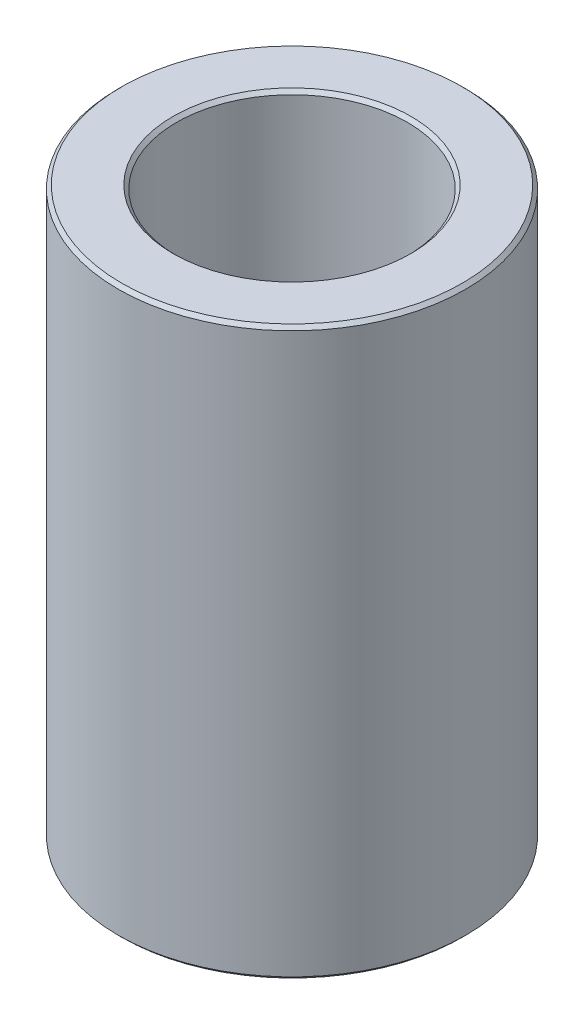
ISO-10303-21;
HEADER;
FILE_DESCRIPTION(('STEP AP214'),'2;1');
FILE_NAME('part.step','',(''),(''),'','','');
FILE_SCHEMA(('AUTOMOTIVE_DESIGN { 1 0 10303 214 1 1 1 1 }'));
ENDSEC;
DATA;
#1=APPLICATION_CONTEXT('core data for automotive mechanical design processes');
#2=APPLICATION_PROTOCOL_DEFINITION('international standard','automotive_design',2000,#1);
#3=PRODUCT_CONTEXT('',#1,'mechanical');
#4=PRODUCT('Part','Part','',(#3));
#5=PRODUCT_RELATED_PRODUCT_CATEGORY('part','',(#4));
#6=PRODUCT_DEFINITION_FORMATION('','',#4);
#7=PRODUCT_DEFINITION_CONTEXT('part definition',#1,'design');
#8=PRODUCT_DEFINITION('design','',#6,#7);
#9=PRODUCT_DEFINITION_SHAPE('','',#8);
#10=(LENGTH_UNIT() NAMED_UNIT(*) SI_UNIT(.MILLI.,.METRE.));
#11=(NAMED_UNIT(*) PLANE_ANGLE_UNIT() SI_UNIT($,.RADIAN.));
#12=(NAMED_UNIT(*) SI_UNIT($,.STERADIAN.) SOLID_ANGLE_UNIT());
#13=UNCERTAINTY_MEASURE_WITH_UNIT(LENGTH_MEASURE(1.E-05),#10,'distance_accuracy_value','');
#14=(GEOMETRIC_REPRESENTATION_CONTEXT(3) GLOBAL_UNCERTAINTY_ASSIGNED_CONTEXT((#13)) GLOBAL_UNIT_ASSIGNED_CONTEXT((#10,
#11,#12)) REPRESENTATION_CONTEXT('',''));
#15=CARTESIAN_POINT('',(0.,0.,0.));
#16=DIRECTION('',(0.,0.,1.));
#17=DIRECTION('',(1.,0.,0.));
#18=AXIS2_PLACEMENT_3D('',#15,#16,#17);
#19=CARTESIAN_POINT('',(0.,171.215724513851,0.));
#20=DIRECTION('',(0.,-1.,0.));
#21=DIRECTION('',(0.,0.,-1.));
#22=AXIS2_PLACEMENT_3D('',#19,#20,#21);
#23=CYLINDRICAL_SURFACE('',#22,52.5);
#24=CARTESIAN_POINT('',(0.,1.0499867533334,0.));
#25=DIRECTION('',(0.,1.,0.));
#26=DIRECTION('',(0.,0.,1.));
#27=AXIS2_PLACEMENT_3D('',#24,#25,#26);
#28=CIRCLE('',#27,52.5);
#29=CARTESIAN_POINT('',(0.,1.0499867533334,52.5));
#30=VERTEX_POINT('',#29);
#31=EDGE_CURVE('E10',#30,#30,#28,.T.);
#32=ORIENTED_EDGE('',*,*,#31,.T.);
#33=EDGE_LOOP('',(#32));
#34=FACE_BOUND('',#33,.T.);
#35=CARTESIAN_POINT('',(0.,170.165737760517,0.));
#36=DIRECTION('',(0.,1.,0.));
#37=DIRECTION('',(0.,0.,1.));
#38=AXIS2_PLACEMENT_3D('',#35,#36,#37);
#39=CIRCLE('',#38,52.5);
#40=CARTESIAN_POINT('',(0.,170.165737760517,52.5));
#41=VERTEX_POINT('',#40);
#42=EDGE_CURVE('E50',#41,#41,#39,.F.);
#43=ORIENTED_EDGE('',*,*,#42,.T.);
#44=EDGE_LOOP('',(#43));
#45=FACE_BOUND('',#44,.T.);
#46=ADVANCED_FACE('F39',(#34,#45),#23,.T.);
#47=CARTESIAN_POINT('',(0.,171.215724513851,0.));
#48=DIRECTION('',(0.,1.,0.));
#49=DIRECTION('',(0.,0.,1.));
#50=AXIS2_PLACEMENT_3D('',#47,#48,#49);
#51=PLANE('',#50);
#52=CARTESIAN_POINT('',(0.,171.215724513851,0.));
#53=DIRECTION('',(0.,1.,0.));
#54=DIRECTION('',(0.,0.,1.));
#55=AXIS2_PLACEMENT_3D('',#52,#53,#54);
#56=CIRCLE('',#55,35.9481811655787);
#57=CARTESIAN_POINT('',(0.,171.215724513851,35.9481811655787));
#58=VERTEX_POINT('',#57);
#59=EDGE_CURVE('E58',#58,#58,#56,.F.);
#60=ORIENTED_EDGE('',*,*,#59,.T.);
#61=EDGE_LOOP('',(#60));
#62=FACE_BOUND('',#61,.T.);
#63=CARTESIAN_POINT('',(0.,171.215724513851,0.));
#64=DIRECTION('',(0.,1.,0.));
#65=DIRECTION('',(0.,0.,1.));
#66=AXIS2_PLACEMENT_3D('',#63,#64,#65);
#67=CIRCLE('',#66,51.4500132466666);
#68=CARTESIAN_POINT('',(0.,171.215724513851,51.4500132466666));
#69=VERTEX_POINT('',#68);
#70=EDGE_CURVE('E61',#69,#69,#67,.T.);
#71=ORIENTED_EDGE('',*,*,#70,.T.);
#72=EDGE_LOOP('',(#71));
#73=FACE_BOUND('',#72,.T.);
#74=ADVANCED_FACE('F88',(#62,#73),#51,.T.);
#75=CARTESIAN_POINT('',(0.,0.,0.));
#76=DIRECTION('',(0.,1.,0.));
#77=DIRECTION('',(0.,0.,1.));
#78=AXIS2_PLACEMENT_3D('',#75,#76,#77);
#79=PLANE('',#78);
#80=CARTESIAN_POINT('',(0.,0.,0.));
#81=DIRECTION('',(0.,1.,0.));
#82=DIRECTION('',(0.,0.,1.));
#83=AXIS2_PLACEMENT_3D('',#80,#81,#82);
#84=CIRCLE('',#83,35.9481811655787);
#85=CARTESIAN_POINT('',(0.,0.,35.9481811655787));
#86=VERTEX_POINT('',#85);
#87=EDGE_CURVE('E51',#86,#86,#84,.T.);
#88=ORIENTED_EDGE('',*,*,#87,.T.);
#89=EDGE_LOOP('',(#88));
#90=FACE_BOUND('',#89,.T.);
#91=CARTESIAN_POINT('',(0.,0.,0.));
#92=DIRECTION('',(0.,1.,0.));
#93=DIRECTION('',(0.,0.,1.));
#94=AXIS2_PLACEMENT_3D('',#91,#92,#93);
#95=CIRCLE('',#94,51.4500132466666);
#96=CARTESIAN_POINT('',(0.,0.,51.4500132466666));
#97=VERTEX_POINT('',#96);
#98=EDGE_CURVE('E54',#97,#97,#95,.F.);
#99=ORIENTED_EDGE('',*,*,#98,.T.);
#100=EDGE_LOOP('',(#99));
#101=FACE_BOUND('',#100,.T.);
#102=ADVANCED_FACE('F83',(#90,#101),#79,.F.);
#103=CARTESIAN_POINT('',(0.,171.215724513851,0.));
#104=DIRECTION('',(0.,-1.,0.));
#105=DIRECTION('',(0.,0.,-1.));
#106=AXIS2_PLACEMENT_3D('',#103,#104,#105);
#107=CYLINDRICAL_SURFACE('',#106,34.8981944122453);
#108=CARTESIAN_POINT('',(0.,170.165737760517,0.));
#109=DIRECTION('',(0.,1.,0.));
#110=DIRECTION('',(0.,0.,1.));
#111=AXIS2_PLACEMENT_3D('',#108,#109,#110);
#112=CIRCLE('',#111,34.8981944122453);
#113=CARTESIAN_POINT('',(0.,170.165737760517,34.8981944122453));
#114=VERTEX_POINT('',#113);
#115=EDGE_CURVE('E67',#114,#114,#112,.T.);
#116=ORIENTED_EDGE('',*,*,#115,.T.);
#117=EDGE_LOOP('',(#116));
#118=FACE_BOUND('',#117,.T.);
#119=CARTESIAN_POINT('',(0.,1.04998675333337,0.));
#120=DIRECTION('',(0.,1.,0.));
#121=DIRECTION('',(0.,0.,1.));
#122=AXIS2_PLACEMENT_3D('',#119,#120,#121);
#123=CIRCLE('',#122,34.8981944122453);
#124=CARTESIAN_POINT('',(0.,1.04998675333337,34.8981944122453));
#125=VERTEX_POINT('',#124);
#126=EDGE_CURVE('E69',#125,#125,#123,.F.);
#127=ORIENTED_EDGE('',*,*,#126,.T.);
#128=EDGE_LOOP('',(#127));
#129=FACE_BOUND('',#128,.T.);
#130=ADVANCED_FACE('F71',(#118,#129),#107,.F.);
#131=CARTESIAN_POINT('',(0.,170.165737760517,0.));
#132=DIRECTION('',(0.,1.,0.));
#133=DIRECTION('',(0.,0.,1.));
#134=AXIS2_PLACEMENT_3D('',#131,#132,#133);
#135=CONICAL_SURFACE('',#134,34.8981944122453,0.785398163397442);
#136=ORIENTED_EDGE('',*,*,#59,.F.);
#137=EDGE_LOOP('',(#136));
#138=FACE_BOUND('',#137,.T.);
#139=ORIENTED_EDGE('',*,*,#115,.F.);
#140=EDGE_LOOP('',(#139));
#141=FACE_BOUND('',#140,.T.);
#142=ADVANCED_FACE('F77',(#138,#141),#135,.F.);
#143=CARTESIAN_POINT('',(0.,0.,0.));
#144=DIRECTION('',(0.,-1.,0.));
#145=DIRECTION('',(0.,0.,-1.));
#146=AXIS2_PLACEMENT_3D('',#143,#144,#145);
#147=CONICAL_SURFACE('',#146,35.9481811655787,0.785398163397442);
#148=ORIENTED_EDGE('',*,*,#126,.F.);
#149=EDGE_LOOP('',(#148));
#150=FACE_BOUND('',#149,.T.);
#151=ORIENTED_EDGE('',*,*,#87,.F.);
#152=EDGE_LOOP('',(#151));
#153=FACE_BOUND('',#152,.T.);
#154=ADVANCED_FACE('F73',(#150,#153),#147,.F.);
#155=CARTESIAN_POINT('',(0.,1.0499867533334,0.));
#156=DIRECTION('',(0.,1.,0.));
#157=DIRECTION('',(0.,0.,1.));
#158=AXIS2_PLACEMENT_3D('',#155,#156,#157);
#159=CONICAL_SURFACE('',#158,52.5,0.785398163397452);
#160=ORIENTED_EDGE('',*,*,#98,.F.);
#161=EDGE_LOOP('',(#160));
#162=FACE_BOUND('',#161,.T.);
#163=ORIENTED_EDGE('',*,*,#31,.F.);
#164=EDGE_LOOP('',(#163));
#165=FACE_BOUND('',#164,.T.);
#166=ADVANCED_FACE('F76',(#162,#165),#159,.T.);
#167=CARTESIAN_POINT('',(0.,171.215724513851,0.));
#168=DIRECTION('',(0.,-1.,0.));
#169=DIRECTION('',(0.,0.,-1.));
#170=AXIS2_PLACEMENT_3D('',#167,#168,#169);
#171=CONICAL_SURFACE('',#170,51.4500132466666,0.785398163397438);
#172=ORIENTED_EDGE('',*,*,#42,.F.);
#173=EDGE_LOOP('',(#172));
#174=FACE_BOUND('',#173,.T.);
#175=ORIENTED_EDGE('',*,*,#70,.F.);
#176=EDGE_LOOP('',(#175));
#177=FACE_BOUND('',#176,.T.);
#178=ADVANCED_FACE('F45',(#174,#177),#171,.T.);
#179=CLOSED_SHELL('',(#46,#74,#102,#130,#142,#154,#166,#178));
#180=MANIFOLD_SOLID_BREP('B2',#179);
#181=ADVANCED_BREP_SHAPE_REPRESENTATION('',(#18,#180),#14);
#182=SHAPE_DEFINITION_REPRESENTATION(#9,#181);
ENDSEC;
END-ISO-10303-21;
